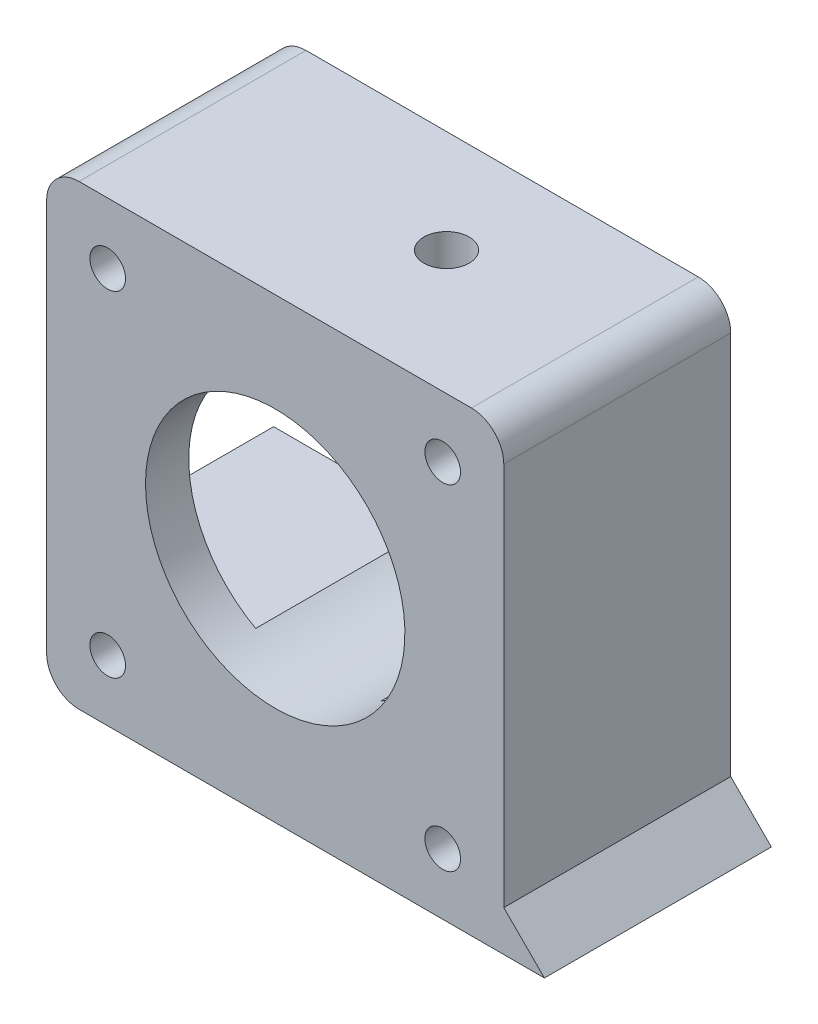
ISO-10303-21;
HEADER;
FILE_DESCRIPTION(('STEP AP214'),'2;1');
FILE_NAME('part.step','',(''),(''),'','','');
FILE_SCHEMA(('AUTOMOTIVE_DESIGN { 1 0 10303 214 1 1 1 1 }'));
ENDSEC;
DATA;
#1=APPLICATION_CONTEXT('core data for automotive mechanical design processes');
#2=APPLICATION_PROTOCOL_DEFINITION('international standard','automotive_design',2000,#1);
#3=PRODUCT_CONTEXT('',#1,'mechanical');
#4=PRODUCT('Part','Part','',(#3));
#5=PRODUCT_RELATED_PRODUCT_CATEGORY('part','',(#4));
#6=PRODUCT_DEFINITION_FORMATION('','',#4);
#7=PRODUCT_DEFINITION_CONTEXT('part definition',#1,'design');
#8=PRODUCT_DEFINITION('design','',#6,#7);
#9=PRODUCT_DEFINITION_SHAPE('','',#8);
#10=(LENGTH_UNIT() NAMED_UNIT(*) SI_UNIT(.MILLI.,.METRE.));
#11=(NAMED_UNIT(*) PLANE_ANGLE_UNIT() SI_UNIT($,.RADIAN.));
#12=(NAMED_UNIT(*) SI_UNIT($,.STERADIAN.) SOLID_ANGLE_UNIT());
#13=UNCERTAINTY_MEASURE_WITH_UNIT(LENGTH_MEASURE(1.E-05),#10,'distance_accuracy_value','');
#14=(GEOMETRIC_REPRESENTATION_CONTEXT(3) GLOBAL_UNCERTAINTY_ASSIGNED_CONTEXT((#13)) GLOBAL_UNIT_ASSIGNED_CONTEXT((#10,
#11,#12)) REPRESENTATION_CONTEXT('',''));
#15=CARTESIAN_POINT('',(0.,0.,0.));
#16=DIRECTION('',(0.,0.,1.));
#17=DIRECTION('',(1.,0.,0.));
#18=AXIS2_PLACEMENT_3D('',#15,#16,#17);
#19=CARTESIAN_POINT('',(0.,0.,0.));
#20=DIRECTION('',(0.,0.,-1.));
#21=DIRECTION('',(-1.,0.,0.));
#22=AXIS2_PLACEMENT_3D('',#19,#20,#21);
#23=PLANE('',#22);
#24=DIRECTION('',(0.,-1.,0.));
#25=VECTOR('',#24,1.);
#26=CARTESIAN_POINT('',(3.55999685738537,-7.02140137308997,0.));
#27=LINE('',#26,#25);
#28=CARTESIAN_POINT('',(3.55999685738537,-11.37140137309,0.));
#29=VERTEX_POINT('',#28);
#30=CARTESIAN_POINT('',(3.55999685738537,-22.02140137309,0.));
#31=VERTEX_POINT('',#30);
#32=EDGE_CURVE('E48',#29,#31,#27,.T.);
#33=ORIENTED_EDGE('',*,*,#32,.F.);
#34=DIRECTION('',(-1.,0.,0.));
#35=VECTOR('',#34,1.);
#36=CARTESIAN_POINT('',(15.9599968573854,-11.37140137309,0.));
#37=LINE('',#36,#35);
#38=CARTESIAN_POINT('',(15.9599968573854,-11.37140137309,0.));
#39=VERTEX_POINT('',#38);
#40=EDGE_CURVE('E228',#39,#29,#37,.T.);
#41=ORIENTED_EDGE('',*,*,#40,.F.);
#42=DIRECTION('',(0.,-1.,0.));
#43=VECTOR('',#42,1.);
#44=CARTESIAN_POINT('',(15.9599968573854,9.62859862691002,0.));
#45=LINE('',#44,#43);
#46=CARTESIAN_POINT('',(15.9599968573854,9.62859862691002,0.));
#47=VERTEX_POINT('',#46);
#48=EDGE_CURVE('E213',#47,#39,#45,.T.);
#49=ORIENTED_EDGE('',*,*,#48,.F.);
#50=DIRECTION('',(-1.,0.,0.));
#51=VECTOR('',#50,1.);
#52=CARTESIAN_POINT('',(15.9599968573854,9.62859862691002,0.));
#53=LINE('',#52,#51);
#54=CARTESIAN_POINT('',(2.91947187669669,9.62859862691002,0.));
#55=VERTEX_POINT('',#54);
#56=EDGE_CURVE('E232',#47,#55,#53,.T.);
#57=ORIENTED_EDGE('',*,*,#56,.T.);
#58=CARTESIAN_POINT('',(-2.89000314261446,-0.871401373089968,0.));
#59=DIRECTION('',(0.,0.,-1.));
#60=DIRECTION('',(-1.,0.,0.));
#61=AXIS2_PLACEMENT_3D('',#58,#59,#60);
#62=CIRCLE('',#61,12.);
#63=CARTESIAN_POINT('',(-8.69947816192561,9.62859862691002,0.));
#64=VERTEX_POINT('',#63);
#65=EDGE_CURVE('E353',#55,#64,#62,.F.);
#66=ORIENTED_EDGE('',*,*,#65,.T.);
#67=CARTESIAN_POINT('',(-24.0400031426146,9.62859862691002,0.));
#68=VERTEX_POINT('',#67);
#69=EDGE_CURVE('E235',#64,#68,#53,.T.);
#70=ORIENTED_EDGE('',*,*,#69,.T.);
#71=DIRECTION('',(0.,-1.,0.));
#72=VECTOR('',#71,1.);
#73=CARTESIAN_POINT('',(-24.0400031426146,20.27859862691,0.));
#74=LINE('',#73,#72);
#75=CARTESIAN_POINT('',(-24.0400031426146,17.27859862691,0.));
#76=VERTEX_POINT('',#75);
#77=EDGE_CURVE('E278',#76,#68,#74,.T.);
#78=ORIENTED_EDGE('',*,*,#77,.F.);
#79=CARTESIAN_POINT('',(-21.0400031426146,17.27859862691,0.));
#80=DIRECTION('',(0.,0.,-1.));
#81=DIRECTION('',(-1.,0.,0.));
#82=AXIS2_PLACEMENT_3D('',#79,#80,#81);
#83=CIRCLE('',#82,3.);
#84=CARTESIAN_POINT('',(-21.0400031426146,20.27859862691,0.));
#85=VERTEX_POINT('',#84);
#86=EDGE_CURVE('E299',#76,#85,#83,.T.);
#87=ORIENTED_EDGE('',*,*,#86,.T.);
#88=DIRECTION('',(-1.,0.,0.));
#89=VECTOR('',#88,1.);
#90=CARTESIAN_POINT('',(-24.0400031426146,20.27859862691,0.));
#91=LINE('',#90,#89);
#92=CARTESIAN_POINT('',(15.2599968573854,20.27859862691,0.));
#93=VERTEX_POINT('',#92);
#94=EDGE_CURVE('E267',#93,#85,#91,.T.);
#95=ORIENTED_EDGE('',*,*,#94,.F.);
#96=CARTESIAN_POINT('',(15.2599968573854,17.27859862691,0.));
#97=DIRECTION('',(0.,0.,-1.));
#98=DIRECTION('',(-1.,0.,0.));
#99=AXIS2_PLACEMENT_3D('',#96,#97,#98);
#100=CIRCLE('',#99,3.);
#101=CARTESIAN_POINT('',(18.2599968573854,17.27859862691,0.));
#102=VERTEX_POINT('',#101);
#103=EDGE_CURVE('E297',#93,#102,#100,.T.);
#104=ORIENTED_EDGE('',*,*,#103,.T.);
#105=DIRECTION('',(0.,1.,0.));
#106=VECTOR('',#105,1.);
#107=CARTESIAN_POINT('',(18.2599968573854,20.27859862691,0.));
#108=LINE('',#107,#106);
#109=CARTESIAN_POINT('',(18.2599968573854,-18.26140137309,0.));
#110=VERTEX_POINT('',#109);
#111=EDGE_CURVE('E285',#110,#102,#108,.T.);
#112=ORIENTED_EDGE('',*,*,#111,.F.);
#113=DIRECTION('',(-0.707106781186553,0.707106781186542,0.));
#114=VECTOR('',#113,1.);
#115=CARTESIAN_POINT('',(18.2599968573854,-18.26140137309,0.));
#116=LINE('',#115,#114);
#117=CARTESIAN_POINT('',(22.0199968573855,-22.02140137309,0.));
#118=VERTEX_POINT('',#117);
#119=EDGE_CURVE('E283',#118,#110,#116,.T.);
#120=ORIENTED_EDGE('',*,*,#119,.F.);
#121=DIRECTION('',(1.,0.,0.));
#122=VECTOR('',#121,1.);
#123=CARTESIAN_POINT('',(22.0199968573855,-22.02140137309,0.));
#124=LINE('',#123,#122);
#125=EDGE_CURVE('E281',#31,#118,#124,.T.);
#126=ORIENTED_EDGE('',*,*,#125,.F.);
#127=EDGE_LOOP('',(#33,#41,#49,#57,#66,#70,#78,#87,#95,#104,#112,#120,#126));
#128=FACE_BOUND('',#127,.T.);
#129=CARTESIAN_POINT('',(12.6099968573857,-16.37140137309,0.));
#130=DIRECTION('',(0.,0.,1.));
#131=DIRECTION('',(1.,0.,0.));
#132=AXIS2_PLACEMENT_3D('',#129,#130,#131);
#133=CIRCLE('',#132,1.65);
#134=CARTESIAN_POINT('',(14.2599968573857,-16.37140137309,0.));
#135=VERTEX_POINT('',#134);
#136=EDGE_CURVE('E226',#135,#135,#133,.T.);
#137=ORIENTED_EDGE('',*,*,#136,.T.);
#138=EDGE_LOOP('',(#137));
#139=FACE_BOUND('',#138,.T.);
#140=CARTESIAN_POINT('',(12.6099968573854,14.62859862691,0.));
#141=DIRECTION('',(0.,0.,1.));
#142=DIRECTION('',(1.,0.,0.));
#143=AXIS2_PLACEMENT_3D('',#140,#141,#142);
#144=CIRCLE('',#143,1.65);
#145=CARTESIAN_POINT('',(14.2599968573854,14.62859862691,0.));
#146=VERTEX_POINT('',#145);
#147=EDGE_CURVE('E248',#146,#146,#144,.T.);
#148=ORIENTED_EDGE('',*,*,#147,.T.);
#149=EDGE_LOOP('',(#148));
#150=FACE_BOUND('',#149,.T.);
#151=CARTESIAN_POINT('',(-18.3900031426146,14.62859862691,0.));
#152=DIRECTION('',(0.,0.,1.));
#153=DIRECTION('',(1.,0.,0.));
#154=AXIS2_PLACEMENT_3D('',#151,#152,#153);
#155=CIRCLE('',#154,1.65);
#156=CARTESIAN_POINT('',(-16.7400031426146,14.62859862691,0.));
#157=VERTEX_POINT('',#156);
#158=EDGE_CURVE('E254',#157,#157,#155,.T.);
#159=ORIENTED_EDGE('',*,*,#158,.T.);
#160=EDGE_LOOP('',(#159));
#161=FACE_BOUND('',#160,.T.);
#162=ADVANCED_FACE('F33',(#128,#139,#150,#161),#23,.T.);
#163=CARTESIAN_POINT('',(15.9599968573854,9.62859862691002,17.));
#164=DIRECTION('',(0.,0.,1.));
#165=DIRECTION('',(1.,0.,0.));
#166=AXIS2_PLACEMENT_3D('',#163,#164,#165);
#167=PLANE('',#166);
#168=CARTESIAN_POINT('',(-2.89000314261446,-0.871401373089968,17.));
#169=DIRECTION('',(0.,0.,1.));
#170=DIRECTION('',(1.,0.,0.));
#171=AXIS2_PLACEMENT_3D('',#168,#169,#170);
#172=CIRCLE('',#171,12.);
#173=CARTESIAN_POINT('',(-8.69947816192557,-11.37140137309,17.));
#174=VERTEX_POINT('',#173);
#175=CARTESIAN_POINT('',(-8.69947816192561,9.62859862691002,17.));
#176=VERTEX_POINT('',#175);
#177=EDGE_CURVE('E348',#174,#176,#172,.F.);
#178=ORIENTED_EDGE('',*,*,#177,.F.);
#179=DIRECTION('',(-1.,0.,0.));
#180=VECTOR('',#179,1.);
#181=CARTESIAN_POINT('',(15.9599968573854,-11.37140137309,17.));
#182=LINE('',#181,#180);
#183=CARTESIAN_POINT('',(-24.0400031426146,-11.37140137309,17.));
#184=VERTEX_POINT('',#183);
#185=EDGE_CURVE('E227',#174,#184,#182,.T.);
#186=ORIENTED_EDGE('',*,*,#185,.T.);
#187=DIRECTION('',(0.,1.,0.));
#188=VECTOR('',#187,1.);
#189=CARTESIAN_POINT('',(-24.0400031426146,9.62859862691002,17.));
#190=LINE('',#189,#188);
#191=CARTESIAN_POINT('',(-24.0400031426146,9.62859862691002,17.));
#192=VERTEX_POINT('',#191);
#193=EDGE_CURVE('E196',#184,#192,#190,.T.);
#194=ORIENTED_EDGE('',*,*,#193,.T.);
#195=DIRECTION('',(-1.,0.,0.));
#196=VECTOR('',#195,1.);
#197=CARTESIAN_POINT('',(15.9599968573854,9.62859862691002,17.));
#198=LINE('',#197,#196);
#199=EDGE_CURVE('E217',#176,#192,#198,.T.);
#200=ORIENTED_EDGE('',*,*,#199,.F.);
#201=EDGE_LOOP('',(#178,#186,#194,#200));
#202=FACE_BOUND('',#201,.T.);
#203=ADVANCED_FACE('F413',(#202),#167,.F.);
#204=CARTESIAN_POINT('',(15.9599968573854,-11.37140137309,17.));
#205=DIRECTION('',(0.,-1.,0.));
#206=DIRECTION('',(0.,0.,-1.));
#207=AXIS2_PLACEMENT_3D('',#204,#205,#206);
#208=PLANE('',#207);
#209=ORIENTED_EDGE('',*,*,#40,.T.);
#210=DIRECTION('',(0.,0.,1.));
#211=VECTOR('',#210,1.);
#212=CARTESIAN_POINT('',(3.55999685738537,-11.37140137309,17.));
#213=LINE('',#212,#211);
#214=CARTESIAN_POINT('',(3.55999685738537,-11.37140137309,9.5));
#215=VERTEX_POINT('',#214);
#216=EDGE_CURVE('E666',#29,#215,#213,.T.);
#217=ORIENTED_EDGE('',*,*,#216,.T.);
#218=CARTESIAN_POINT('',(1.45999685738537,-11.37140137309,9.5));
#219=DIRECTION('',(0.,-1.,0.));
#220=DIRECTION('',(0.,0.,-1.));
#221=AXIS2_PLACEMENT_3D('',#218,#219,#220);
#222=CIRCLE('',#221,2.1);
#223=CARTESIAN_POINT('',(2.91947187669666,-11.37140137309,11.0099445910385));
#224=VERTEX_POINT('',#223);
#225=EDGE_CURVE('E197',#215,#224,#222,.T.);
#226=ORIENTED_EDGE('',*,*,#225,.T.);
#227=DIRECTION('',(0.,0.,1.));
#228=VECTOR('',#227,1.);
#229=CARTESIAN_POINT('',(2.91947187669665,-11.37140137309,-10.));
#230=LINE('',#229,#228);
#231=CARTESIAN_POINT('',(2.91947187669665,-11.37140137309,17.));
#232=VERTEX_POINT('',#231);
#233=EDGE_CURVE('E674',#232,#224,#230,.F.);
#234=ORIENTED_EDGE('',*,*,#233,.F.);
#235=CARTESIAN_POINT('',(15.9599968573854,-11.37140137309,17.));
#236=VERTEX_POINT('',#235);
#237=EDGE_CURVE('E223',#236,#232,#182,.T.);
#238=ORIENTED_EDGE('',*,*,#237,.F.);
#239=DIRECTION('',(0.,0.,1.));
#240=VECTOR('',#239,1.);
#241=CARTESIAN_POINT('',(15.9599968573854,-11.37140137309,17.));
#242=LINE('',#241,#240);
#243=EDGE_CURVE('E215',#39,#236,#242,.T.);
#244=ORIENTED_EDGE('',*,*,#243,.F.);
#245=EDGE_LOOP('',(#209,#217,#226,#234,#238,#244));
#246=FACE_BOUND('',#245,.T.);
#247=ADVANCED_FACE('F419',(#246),#208,.F.);
#248=DIRECTION('',(0.,0.,1.));
#249=VECTOR('',#248,1.);
#250=CARTESIAN_POINT('',(-8.69947816192557,-11.37140137309,-10.));
#251=LINE('',#250,#249);
#252=CARTESIAN_POINT('',(-8.69947816192557,-11.37140137309,0.));
#253=VERTEX_POINT('',#252);
#254=EDGE_CURVE('E349',#253,#174,#251,.T.);
#255=ORIENTED_EDGE('',*,*,#254,.F.);
#256=CARTESIAN_POINT('',(-24.0400031426146,-11.37140137309,0.));
#257=VERTEX_POINT('',#256);
#258=EDGE_CURVE('E231',#253,#257,#37,.T.);
#259=ORIENTED_EDGE('',*,*,#258,.T.);
#260=DIRECTION('',(0.,0.,1.));
#261=VECTOR('',#260,1.);
#262=CARTESIAN_POINT('',(-24.0400031426146,-11.37140137309,17.));
#263=LINE('',#262,#261);
#264=EDGE_CURVE('E210',#257,#184,#263,.T.);
#265=ORIENTED_EDGE('',*,*,#264,.T.);
#266=ORIENTED_EDGE('',*,*,#185,.F.);
#267=EDGE_LOOP('',(#255,#259,#265,#266));
#268=FACE_BOUND('',#267,.T.);
#269=ADVANCED_FACE('F552',(#268),#208,.F.);
#270=CARTESIAN_POINT('',(15.9599968573854,9.62859862691002,0.));
#271=DIRECTION('',(0.,1.,0.));
#272=DIRECTION('',(-1.,0.,0.));
#273=AXIS2_PLACEMENT_3D('',#270,#271,#272);
#274=PLANE('',#273);
#275=DIRECTION('',(0.,0.,1.));
#276=VECTOR('',#275,1.);
#277=CARTESIAN_POINT('',(-8.69947816192561,9.62859862691002,-10.));
#278=LINE('',#277,#276);
#279=EDGE_CURVE('E351',#176,#64,#278,.F.);
#280=ORIENTED_EDGE('',*,*,#279,.F.);
#281=ORIENTED_EDGE('',*,*,#199,.T.);
#282=DIRECTION('',(0.,0.,-1.));
#283=VECTOR('',#282,1.);
#284=CARTESIAN_POINT('',(-24.0400031426146,9.62859862691002,0.));
#285=LINE('',#284,#283);
#286=EDGE_CURVE('E200',#192,#68,#285,.T.);
#287=ORIENTED_EDGE('',*,*,#286,.T.);
#288=ORIENTED_EDGE('',*,*,#69,.F.);
#289=EDGE_LOOP('',(#280,#281,#287,#288));
#290=FACE_BOUND('',#289,.T.);
#291=ADVANCED_FACE('F557',(#290),#274,.F.);
#292=DIRECTION('',(0.,0.,1.));
#293=VECTOR('',#292,1.);
#294=CARTESIAN_POINT('',(2.91947187669669,9.62859862691002,-10.));
#295=LINE('',#294,#293);
#296=CARTESIAN_POINT('',(2.91947187669668,9.62859862691003,7.99005540896156));
#297=VERTEX_POINT('',#296);
#298=EDGE_CURVE('E347',#55,#297,#295,.T.);
#299=ORIENTED_EDGE('',*,*,#298,.F.);
#300=ORIENTED_EDGE('',*,*,#56,.F.);
#301=DIRECTION('',(0.,0.,-1.));
#302=VECTOR('',#301,1.);
#303=CARTESIAN_POINT('',(15.9599968573854,9.62859862691002,0.));
#304=LINE('',#303,#302);
#305=CARTESIAN_POINT('',(15.9599968573854,9.62859862691002,17.));
#306=VERTEX_POINT('',#305);
#307=EDGE_CURVE('E209',#306,#47,#304,.T.);
#308=ORIENTED_EDGE('',*,*,#307,.F.);
#309=CARTESIAN_POINT('',(2.91947187669669,9.62859862691002,17.));
#310=VERTEX_POINT('',#309);
#311=EDGE_CURVE('E236',#306,#310,#198,.T.);
#312=ORIENTED_EDGE('',*,*,#311,.T.);
#313=CARTESIAN_POINT('',(2.91947187669669,9.62859862691003,11.0099445910384));
#314=VERTEX_POINT('',#313);
#315=EDGE_CURVE('E680',#314,#310,#295,.T.);
#316=ORIENTED_EDGE('',*,*,#315,.F.);
#317=CARTESIAN_POINT('',(1.45999685738537,9.62859862691003,9.5));
#318=DIRECTION('',(0.,1.,0.));
#319=DIRECTION('',(-1.,0.,0.));
#320=AXIS2_PLACEMENT_3D('',#317,#318,#319);
#321=CIRCLE('',#320,2.1);
#322=EDGE_CURVE('E202',#314,#297,#321,.T.);
#323=ORIENTED_EDGE('',*,*,#322,.T.);
#324=EDGE_LOOP('',(#299,#300,#308,#312,#316,#323));
#325=FACE_BOUND('',#324,.T.);
#326=ADVANCED_FACE('F567',(#325),#274,.F.);
#327=CARTESIAN_POINT('',(1.45999685738537,-34.72140137309,9.5));
#328=DIRECTION('',(0.,1.,0.));
#329=DIRECTION('',(0.,0.,1.));
#330=AXIS2_PLACEMENT_3D('',#327,#328,#329);
#331=CYLINDRICAL_SURFACE('',#330,2.1);
#332=CARTESIAN_POINT('',(1.45999685738537,20.27859862691,9.5));
#333=DIRECTION('',(0.,1.,0.));
#334=DIRECTION('',(0.,0.,1.));
#335=AXIS2_PLACEMENT_3D('',#332,#333,#334);
#336=CIRCLE('',#335,2.1);
#337=CARTESIAN_POINT('',(1.45999685738537,20.27859862691,11.6));
#338=VERTEX_POINT('',#337);
#339=EDGE_CURVE('E323',#338,#338,#336,.T.);
#340=ORIENTED_EDGE('',*,*,#339,.T.);
#341=EDGE_LOOP('',(#340));
#342=FACE_BOUND('',#341,.T.);
#343=CARTESIAN_POINT('',(2.91947187669668,9.62859862691003,7.99005540896156));
#344=CARTESIAN_POINT('',(2.87301088734067,9.65430634754156,7.9451562215829));
#345=CARTESIAN_POINT('',(2.82469738280091,9.68063245314042,7.90259689768021));
#346=CARTESIAN_POINT('',(2.72469598338791,9.73418053450045,7.82230654351716));
#347=CARTESIAN_POINT('',(2.67300896029508,9.76140227791739,7.78457427325776));
#348=CARTESIAN_POINT('',(2.5134084522869,9.84388800109616,7.67884930727655));
#349=CARTESIAN_POINT('',(2.40090018332738,9.90000346790074,7.61827537608941));
#350=CARTESIAN_POINT('',(2.16679058377834,10.0118737812288,7.5184236503312));
#351=CARTESIAN_POINT('',(2.04519366082369,10.067628788489,7.47913560823222));
#352=CARTESIAN_POINT('',(1.79584752721615,10.1767339380936,7.42310017717634));
#353=CARTESIAN_POINT('',(1.66809939031723,10.2300844970325,7.40634886888289));
#354=CARTESIAN_POINT('',(1.41018290126881,10.3325094927628,7.3966349561884));
#355=CARTESIAN_POINT('',(1.28001844331849,10.3815901890949,7.40363690596981));
#356=CARTESIAN_POINT('',(1.02130017631667,10.4741067450121,7.44217952257729));
#357=CARTESIAN_POINT('',(0.892745774817818,10.5175447395677,7.47371087672427));
#358=CARTESIAN_POINT('',(0.650361343844336,10.5951131561993,7.55838542882709));
#359=CARTESIAN_POINT('',(0.536119921496784,10.6296693420093,7.60995997885671));
#360=CARTESIAN_POINT('',(0.317414299809351,10.6925694328075,7.73357380654166));
#361=CARTESIAN_POINT('',(0.212946115073686,10.7209158764283,7.8056046935904));
#362=CARTESIAN_POINT('',(0.024130904077665,10.7697646626721,7.96298340442897));
#363=CARTESIAN_POINT('',(-0.0610769157265639,10.790653509275,8.04718075508071));
#364=CARTESIAN_POINT('',(-0.216360988974307,10.8272316889855,8.22950673215559));
#365=CARTESIAN_POINT('',(-0.286440107311133,10.8429220068301,8.32763271509633));
#366=CARTESIAN_POINT('',(-0.407020423033249,10.8690627150111,8.53158172044062));
#367=CARTESIAN_POINT('',(-0.458076521196395,10.8796647633824,8.63705780067353));
#368=CARTESIAN_POINT('',(-0.542016813035271,10.8967253379926,8.85532237701977));
#369=CARTESIAN_POINT('',(-0.574902125803139,10.9031841194087,8.96811042232977));
#370=CARTESIAN_POINT('',(-0.621220883764604,10.9121967244049,9.19667449719368));
#371=CARTESIAN_POINT('',(-0.634830690198114,10.9147859645867,9.31241344053529));
#372=CARTESIAN_POINT('',(-0.642740023593041,10.9162967123904,9.54457303528718));
#373=CARTESIAN_POINT('',(-0.637039821416426,10.9152182714588,9.6609936771124));
#374=CARTESIAN_POINT('',(-0.606529263144325,10.9093449263472,9.89104331535416));
#375=CARTESIAN_POINT('',(-0.581745186033767,10.904555132738,10.0046759291088));
#376=CARTESIAN_POINT('',(-0.5138821199863,10.8910488980822,10.2260912370988));
#377=CARTESIAN_POINT('',(-0.470803482047369,10.8823325323703,10.3338740435234));
#378=CARTESIAN_POINT('',(-0.367698279811135,10.8606377134061,10.5406156886835));
#379=CARTESIAN_POINT('',(-0.307661592884958,10.8476567137436,10.639569210461));
#380=CARTESIAN_POINT('',(-0.172602469693561,10.8170763436501,10.8258409070595));
#381=CARTESIAN_POINT('',(-0.0975803358894269,10.7994770664305,10.9131593166603));
#382=CARTESIAN_POINT('',(0.0654574808517383,10.7592616833816,11.0743158976984));
#383=CARTESIAN_POINT('',(0.153542872032627,10.7366183139533,11.1480766771571));
#384=CARTESIAN_POINT('',(0.33953340337068,10.6862525799156,11.2797610878688));
#385=CARTESIAN_POINT('',(0.437439192877249,10.6585298793478,11.3376836709156));
#386=CARTESIAN_POINT('',(0.642224245062372,10.5974702979901,11.4376561102772));
#387=CARTESIAN_POINT('',(0.749252085374086,10.5640246847937,11.4793344239841));
#388=CARTESIAN_POINT('',(0.967156341251526,10.4923779602586,11.5445172703839));
#389=CARTESIAN_POINT('',(1.07803335269754,10.4541761102303,11.5680189759755));
#390=CARTESIAN_POINT('',(1.30612418006415,10.3717265118637,11.5976634507574));
#391=CARTESIAN_POINT('',(1.42338151587841,10.3272738495699,11.6028958842219));
#392=CARTESIAN_POINT('',(1.65583658879806,10.2349484711356,11.5940848887562));
#393=CARTESIAN_POINT('',(1.77103307086044,10.1870737540738,11.5800300934704));
#394=CARTESIAN_POINT('',(2.00462256587723,10.0857860839585,11.531892641358));
#395=CARTESIAN_POINT('',(2.12267366101802,10.0322201499684,11.4964752112035));
#396=CARTESIAN_POINT('',(2.35054062704294,9.92455009238535,11.4057684862207));
#397=CARTESIAN_POINT('',(2.46036208846327,9.87044636295041,11.3504928320823));
#398=CARTESIAN_POINT('',(2.62829426861122,9.78474725939713,11.2466170620424));
#399=CARTESIAN_POINT('',(2.68982367339744,9.75262869192974,11.2038687398881));
#400=CARTESIAN_POINT('',(2.80823538288824,9.6895925669546,11.1117879282568));
#401=CARTESIAN_POINT('',(2.8651242928364,9.65867333642553,11.0624650701677));
#402=CARTESIAN_POINT('',(2.91947187669668,9.62859862691003,11.0099445910384));
#403=B_SPLINE_CURVE_WITH_KNOTS('',3,(#343,#344,#345,#346,#347,#348,#349,#350,#351,#352,#353,
#354,#355,#356,#357,#358,#359,#360,#361,#362,#363,#364,#365,#366,#367,#368,#369,#370,#371,#372,
#373,#374,#375,#376,#377,#378,#379,#380,#381,#382,#383,#384,#385,#386,#387,#388,#389,#390,#391,
#392,#393,#394,#395,#396,#397,#398,#399,#400,#401,#402),.UNSPECIFIED.,.F.,.F.,(4,2,2,2,2,2,2,2,
2,2,2,2,2,2,2,2,2,2,2,2,2,2,2,2,2,2,2,2,2,4),(0.,0.208463338347776,0.416873017537777,
0.833447413605713,1.24982108234984,1.66612233068065,2.0818026265894,2.49732518490828,
2.88534402371744,3.27320393755252,3.63618661801617,3.99910050072946,4.35039709155337,
4.70167204450773,5.04971177366124,5.3977466208731,5.74530307036276,6.09285285196348,
6.44061053362118,6.78836119696702,7.13803915758511,7.48774025504957,7.84502661910938,
8.20236854258423,8.57728055078269,8.95241359714992,9.35384109427732,9.75499337489747,
9.99917079937089,10.2429943679857),.UNSPECIFIED.);
#404=EDGE_CURVE('E341',#297,#314,#403,.T.);
#405=ORIENTED_EDGE('',*,*,#404,.F.);
#406=ORIENTED_EDGE('',*,*,#322,.F.);
#407=EDGE_LOOP('',(#405,#406));
#408=FACE_BOUND('',#407,.T.);
#409=ADVANCED_FACE('F329',(#342,#408),#331,.F.);
#410=ORIENTED_EDGE('',*,*,#225,.F.);
#411=DIRECTION('',(0.,-1.,0.));
#412=VECTOR('',#411,1.);
#413=CARTESIAN_POINT('',(3.55999685738537,-7.02140137308997,9.5));
#414=LINE('',#413,#412);
#415=CARTESIAN_POINT('',(3.55999685738537,-22.02140137309,9.5));
#416=VERTEX_POINT('',#415);
#417=EDGE_CURVE('E195',#215,#416,#414,.T.);
#418=ORIENTED_EDGE('',*,*,#417,.T.);
#419=CARTESIAN_POINT('',(1.45999685738537,-22.02140137309,9.5));
#420=DIRECTION('',(0.,1.,0.));
#421=DIRECTION('',(0.,0.,1.));
#422=AXIS2_PLACEMENT_3D('',#419,#420,#421);
#423=CIRCLE('',#422,2.1);
#424=CARTESIAN_POINT('',(-0.640003142614627,-22.02140137309,9.5));
#425=VERTEX_POINT('',#424);
#426=EDGE_CURVE('E187',#425,#416,#423,.T.);
#427=ORIENTED_EDGE('',*,*,#426,.F.);
#428=DIRECTION('',(0.,-1.,0.));
#429=VECTOR('',#428,1.);
#430=CARTESIAN_POINT('',(-0.640003142614627,-7.02140137308997,9.5));
#431=LINE('',#430,#429);
#432=CARTESIAN_POINT('',(-0.640003142614627,-12.6585766072163,9.5));
#433=VERTEX_POINT('',#432);
#434=EDGE_CURVE('E173',#433,#425,#431,.T.);
#435=ORIENTED_EDGE('',*,*,#434,.F.);
#436=CARTESIAN_POINT('',(2.91947187669666,-11.37140137309,11.0099445910385));
#437=CARTESIAN_POINT('',(2.87301088734065,-11.3971090937215,11.0548437784171));
#438=CARTESIAN_POINT('',(2.82469738280089,-11.4234351993204,11.0974031023198));
#439=CARTESIAN_POINT('',(2.72469598338789,-11.4769832806804,11.1776934564829));
#440=CARTESIAN_POINT('',(2.67300896029505,-11.5042050240973,11.2154257267423));
#441=CARTESIAN_POINT('',(2.51340845228688,-11.5866907472761,11.3211506927235));
#442=CARTESIAN_POINT('',(2.40090018332736,-11.6428062140807,11.3817246239106));
#443=CARTESIAN_POINT('',(2.16679058377832,-11.7546765274087,11.4815763496688));
#444=CARTESIAN_POINT('',(2.04519366082366,-11.8104315346689,11.5208643917678));
#445=CARTESIAN_POINT('',(1.79584752721613,-11.9195366842735,11.5768998228237));
#446=CARTESIAN_POINT('',(1.6680993903172,-11.9728872432125,11.5936511311171));
#447=CARTESIAN_POINT('',(1.41018290126878,-12.0753122389427,11.6033650438116));
#448=CARTESIAN_POINT('',(1.28001844331846,-12.1243929352748,11.5963630940302));
#449=CARTESIAN_POINT('',(1.02130017631664,-12.2169094911921,11.5578204774227));
#450=CARTESIAN_POINT('',(0.892745774817791,-12.2603474857477,11.5262891232757));
#451=CARTESIAN_POINT('',(0.65036134384431,-12.3379159023793,11.4416145711729));
#452=CARTESIAN_POINT('',(0.536119921496759,-12.3724720881892,11.3900400211433));
#453=CARTESIAN_POINT('',(0.317414299809327,-12.4353721789875,11.2664261934583));
#454=CARTESIAN_POINT('',(0.212946115073663,-12.4637186226082,11.1943953064096));
#455=CARTESIAN_POINT('',(0.0241309040776454,-12.512567408852,11.037016595571));
#456=CARTESIAN_POINT('',(-0.061076915726582,-12.5334562554549,10.9528192449193));
#457=CARTESIAN_POINT('',(-0.216360988974323,-12.5700344351655,10.7704932678444));
#458=CARTESIAN_POINT('',(-0.286440107311148,-12.58572475301,10.6723672849036));
#459=CARTESIAN_POINT('',(-0.407020423033262,-12.611865461191,10.4684182795594));
#460=CARTESIAN_POINT('',(-0.458076521196406,-12.6224675095623,10.3629421993264));
#461=CARTESIAN_POINT('',(-0.542016813035279,-12.6395280841725,10.1446776229802));
#462=CARTESIAN_POINT('',(-0.574902125803145,-12.6459868655887,10.0318895776702));
#463=CARTESIAN_POINT('',(-0.621220883764608,-12.6549994705848,9.8033255028063));
#464=CARTESIAN_POINT('',(-0.634830690198116,-12.6575887107667,9.68758655946469));
#465=CARTESIAN_POINT('',(-0.642740023593041,-12.6590994585703,9.45542696471279));
#466=CARTESIAN_POINT('',(-0.637039821416424,-12.6580210176388,9.33900632288757));
#467=CARTESIAN_POINT('',(-0.606529263144321,-12.6521476725272,9.10895668464582));
#468=CARTESIAN_POINT('',(-0.581745186033761,-12.6473578789179,8.9953240708912));
#469=CARTESIAN_POINT('',(-0.513882119986292,-12.6338516442621,8.77390876290115));
#470=CARTESIAN_POINT('',(-0.47080348204736,-12.6251352785503,8.66612595647653));
#471=CARTESIAN_POINT('',(-0.367698279811123,-12.603440459586,8.45938431131643));
#472=CARTESIAN_POINT('',(-0.307661592884944,-12.5904594599235,8.360430789539));
#473=CARTESIAN_POINT('',(-0.172602469693546,-12.55987908983,8.17415909294051));
#474=CARTESIAN_POINT('',(-0.0975803358894115,-12.5422798126104,8.08684068333964));
#475=CARTESIAN_POINT('',(0.065457480851755,-12.5020644295615,7.92568410230161));
#476=CARTESIAN_POINT('',(0.153542872032645,-12.4794210601332,7.85192332284284));
#477=CARTESIAN_POINT('',(0.3395334033707,-12.4290553260956,7.72023891213118));
#478=CARTESIAN_POINT('',(0.43743919287727,-12.4013326255277,7.66231632908441));
#479=CARTESIAN_POINT('',(0.642224245062396,-12.34027304417,7.56234388972276));
#480=CARTESIAN_POINT('',(0.749252085374111,-12.3068274309736,7.52066557601592));
#481=CARTESIAN_POINT('',(0.967156341251552,-12.2351807064385,7.45548272961614));
#482=CARTESIAN_POINT('',(1.07803335269756,-12.1969788564102,7.43198102402446));
#483=CARTESIAN_POINT('',(1.30612418006418,-12.1145292580436,7.40233654924262));
#484=CARTESIAN_POINT('',(1.42338151587844,-12.0700765957498,7.3971041157781));
#485=CARTESIAN_POINT('',(1.65583658879809,-11.9777512173155,7.40591511124381));
#486=CARTESIAN_POINT('',(1.77103307086046,-11.9298765002537,7.41996990652965));
#487=CARTESIAN_POINT('',(2.00462256587726,-11.8285888301384,7.46810735864203));
#488=CARTESIAN_POINT('',(2.12267366101805,-11.7750228961483,7.50352478879655));
#489=CARTESIAN_POINT('',(2.35054062704297,-11.6673528385653,7.59423151377933));
#490=CARTESIAN_POINT('',(2.4603620884633,-11.6132491091303,7.64950716791772));
#491=CARTESIAN_POINT('',(2.62829426861124,-11.5275500055771,7.75338293795763));
#492=CARTESIAN_POINT('',(2.68982367339745,-11.4954314381097,7.79613126011192));
#493=CARTESIAN_POINT('',(2.80823538288824,-11.4323953131345,7.88821207174319));
#494=CARTESIAN_POINT('',(2.86512429283639,-11.4014760826055,7.9375349298323));
#495=CARTESIAN_POINT('',(2.91947187669666,-11.37140137309,7.99005540896154));
#496=B_SPLINE_CURVE_WITH_KNOTS('',3,(#436,#437,#438,#439,#440,#441,#442,#443,#444,#445,#446,
#447,#448,#449,#450,#451,#452,#453,#454,#455,#456,#457,#458,#459,#460,#461,#462,#463,#464,#465,
#466,#467,#468,#469,#470,#471,#472,#473,#474,#475,#476,#477,#478,#479,#480,#481,#482,#483,#484,
#485,#486,#487,#488,#489,#490,#491,#492,#493,#494,#495),.UNSPECIFIED.,.F.,.F.,(4,2,2,2,2,2,2,2,
2,2,2,2,2,2,2,2,2,2,2,2,2,2,2,2,2,2,2,2,2,4),(0.,0.208463338347777,0.416873017537779,
0.833447413605715,1.24982108234984,1.66612233068065,2.0818026265894,2.49732518490829,
2.88534402371745,3.27320393755253,3.63618661801617,3.99910050072946,4.35039709155337,
4.70167204450773,5.04971177366124,5.3977466208731,5.74530307036276,6.09285285196347,
6.44061053362117,6.78836119696702,7.13803915758511,7.48774025504957,7.84502661910937,
8.20236854258423,8.57728055078269,8.95241359714992,9.35384109427732,9.75499337489747,
9.99917079937086,10.2429943679857),.UNSPECIFIED.);
#497=EDGE_CURVE('E41',#224,#433,#496,.T.);
#498=ORIENTED_EDGE('',*,*,#497,.F.);
#499=EDGE_LOOP('',(#410,#418,#427,#435,#498));
#500=FACE_BOUND('',#499,.T.);
#501=ADVANCED_FACE('F194',(#500),#331,.F.);
#502=CARTESIAN_POINT('',(0.,0.,21.));
#503=DIRECTION('',(0.,0.,-1.));
#504=DIRECTION('',(-1.,0.,0.));
#505=AXIS2_PLACEMENT_3D('',#502,#503,#504);
#506=PLANE('',#505);
#507=CARTESIAN_POINT('',(-2.89000314261446,-0.871401373089968,21.));
#508=DIRECTION('',(0.,0.,-1.));
#509=DIRECTION('',(-1.,0.,0.));
#510=AXIS2_PLACEMENT_3D('',#507,#508,#509);
#511=CIRCLE('',#510,12.);
#512=CARTESIAN_POINT('',(-14.8900031426145,-0.871401373089968,21.));
#513=VERTEX_POINT('',#512);
#514=EDGE_CURVE('E354',#513,#513,#511,.F.);
#515=ORIENTED_EDGE('',*,*,#514,.F.);
#516=EDGE_LOOP('',(#515));
#517=FACE_BOUND('',#516,.T.);
#518=DIRECTION('',(0.,-1.,0.));
#519=VECTOR('',#518,1.);
#520=CARTESIAN_POINT('',(-24.0400031426146,20.27859862691,21.));
#521=LINE('',#520,#519);
#522=CARTESIAN_POINT('',(-24.0400031426146,17.27859862691,21.));
#523=VERTEX_POINT('',#522);
#524=CARTESIAN_POINT('',(-24.0400031426146,-19.02140137309,21.));
#525=VERTEX_POINT('',#524);
#526=EDGE_CURVE('E263',#523,#525,#521,.T.);
#527=ORIENTED_EDGE('',*,*,#526,.T.);
#528=CARTESIAN_POINT('',(-21.0400031426146,-19.02140137309,21.));
#529=DIRECTION('',(0.,0.,-1.));
#530=DIRECTION('',(-1.,0.,0.));
#531=AXIS2_PLACEMENT_3D('',#528,#529,#530);
#532=CIRCLE('',#531,3.);
#533=CARTESIAN_POINT('',(-21.0400031426146,-22.02140137309,21.));
#534=VERTEX_POINT('',#533);
#535=EDGE_CURVE('E313',#525,#534,#532,.F.);
#536=ORIENTED_EDGE('',*,*,#535,.T.);
#537=DIRECTION('',(1.,0.,0.));
#538=VECTOR('',#537,1.);
#539=CARTESIAN_POINT('',(-6.95421670498766,-22.02140137309,21.));
#540=LINE('',#539,#538);
#541=CARTESIAN_POINT('',(22.0199968573855,-22.02140137309,21.));
#542=VERTEX_POINT('',#541);
#543=EDGE_CURVE('E266',#534,#542,#540,.T.);
#544=ORIENTED_EDGE('',*,*,#543,.T.);
#545=DIRECTION('',(-0.707106781186553,0.707106781186542,0.));
#546=VECTOR('',#545,1.);
#547=CARTESIAN_POINT('',(18.2599968573854,-18.26140137309,21.));
#548=LINE('',#547,#546);
#549=CARTESIAN_POINT('',(18.2599968573854,-18.26140137309,21.));
#550=VERTEX_POINT('',#549);
#551=EDGE_CURVE('E269',#542,#550,#548,.T.);
#552=ORIENTED_EDGE('',*,*,#551,.T.);
#553=DIRECTION('',(0.,1.,0.));
#554=VECTOR('',#553,1.);
#555=CARTESIAN_POINT('',(18.2599968573854,20.27859862691,21.));
#556=LINE('',#555,#554);
#557=CARTESIAN_POINT('',(18.2599968573854,17.27859862691,21.));
#558=VERTEX_POINT('',#557);
#559=EDGE_CURVE('E271',#550,#558,#556,.T.);
#560=ORIENTED_EDGE('',*,*,#559,.T.);
#561=CARTESIAN_POINT('',(15.2599968573854,17.27859862691,21.));
#562=DIRECTION('',(0.,0.,-1.));
#563=DIRECTION('',(-1.,0.,0.));
#564=AXIS2_PLACEMENT_3D('',#561,#562,#563);
#565=CIRCLE('',#564,3.);
#566=CARTESIAN_POINT('',(15.2599968573854,20.27859862691,21.));
#567=VERTEX_POINT('',#566);
#568=EDGE_CURVE('E309',#558,#567,#565,.F.);
#569=ORIENTED_EDGE('',*,*,#568,.T.);
#570=DIRECTION('',(-1.,0.,0.));
#571=VECTOR('',#570,1.);
#572=CARTESIAN_POINT('',(-24.0400031426146,20.27859862691,21.));
#573=LINE('',#572,#571);
#574=CARTESIAN_POINT('',(-21.0400031426146,20.27859862691,21.));
#575=VERTEX_POINT('',#574);
#576=EDGE_CURVE('E274',#567,#575,#573,.T.);
#577=ORIENTED_EDGE('',*,*,#576,.T.);
#578=CARTESIAN_POINT('',(-21.0400031426146,17.27859862691,21.));
#579=DIRECTION('',(0.,0.,-1.));
#580=DIRECTION('',(-1.,0.,0.));
#581=AXIS2_PLACEMENT_3D('',#578,#579,#580);
#582=CIRCLE('',#581,3.);
#583=EDGE_CURVE('E311',#575,#523,#582,.F.);
#584=ORIENTED_EDGE('',*,*,#583,.T.);
#585=EDGE_LOOP('',(#527,#536,#544,#552,#560,#569,#577,#584));
#586=FACE_BOUND('',#585,.T.);
#587=CARTESIAN_POINT('',(-18.3900031426146,14.62859862691,21.));
#588=DIRECTION('',(0.,0.,1.));
#589=DIRECTION('',(1.,0.,0.));
#590=AXIS2_PLACEMENT_3D('',#587,#588,#589);
#591=CIRCLE('',#590,1.65);
#592=CARTESIAN_POINT('',(-16.7400031426146,14.62859862691,21.));
#593=VERTEX_POINT('',#592);
#594=EDGE_CURVE('E257',#593,#593,#591,.T.);
#595=ORIENTED_EDGE('',*,*,#594,.F.);
#596=EDGE_LOOP('',(#595));
#597=FACE_BOUND('',#596,.T.);
#598=CARTESIAN_POINT('',(12.6099968573854,14.62859862691,21.));
#599=DIRECTION('',(0.,0.,1.));
#600=DIRECTION('',(1.,0.,0.));
#601=AXIS2_PLACEMENT_3D('',#598,#599,#600);
#602=CIRCLE('',#601,1.65);
#603=CARTESIAN_POINT('',(14.2599968573854,14.62859862691,21.));
#604=VERTEX_POINT('',#603);
#605=EDGE_CURVE('E251',#604,#604,#602,.T.);
#606=ORIENTED_EDGE('',*,*,#605,.F.);
#607=EDGE_LOOP('',(#606));
#608=FACE_BOUND('',#607,.T.);
#609=CARTESIAN_POINT('',(-18.3900031426143,-16.37140137309,21.));
#610=DIRECTION('',(0.,0.,1.));
#611=DIRECTION('',(1.,0.,0.));
#612=AXIS2_PLACEMENT_3D('',#609,#610,#611);
#613=CIRCLE('',#612,1.65);
#614=CARTESIAN_POINT('',(-16.7400031426143,-16.37140137309,21.));
#615=VERTEX_POINT('',#614);
#616=EDGE_CURVE('E245',#615,#615,#613,.T.);
#617=ORIENTED_EDGE('',*,*,#616,.F.);
#618=EDGE_LOOP('',(#617));
#619=FACE_BOUND('',#618,.T.);
#620=CARTESIAN_POINT('',(12.6099968573857,-16.37140137309,21.));
#621=DIRECTION('',(0.,0.,1.));
#622=DIRECTION('',(1.,0.,0.));
#623=AXIS2_PLACEMENT_3D('',#620,#621,#622);
#624=CIRCLE('',#623,1.65);
#625=CARTESIAN_POINT('',(14.2599968573857,-16.37140137309,21.));
#626=VERTEX_POINT('',#625);
#627=EDGE_CURVE('E239',#626,#626,#624,.T.);
#628=ORIENTED_EDGE('',*,*,#627,.F.);
#629=EDGE_LOOP('',(#628));
#630=FACE_BOUND('',#629,.T.);
#631=ADVANCED_FACE('F378',(#517,#586,#597,#608,#619,#630),#506,.F.);
#632=DIRECTION('',(0.,-1.,0.));
#633=VECTOR('',#632,1.);
#634=CARTESIAN_POINT('',(-0.640003142614626,-7.02140137308997,0.));
#635=LINE('',#634,#633);
#636=CARTESIAN_POINT('',(-0.640003142614626,-12.6585766072163,0.));
#637=VERTEX_POINT('',#636);
#638=CARTESIAN_POINT('',(-0.640003142614626,-22.02140137309,0.));
#639=VERTEX_POINT('',#638);
#640=EDGE_CURVE('E55',#637,#639,#635,.T.);
#641=ORIENTED_EDGE('',*,*,#640,.T.);
#642=CARTESIAN_POINT('',(-21.0400031426146,-22.02140137309,0.));
#643=VERTEX_POINT('',#642);
#644=EDGE_CURVE('E190',#643,#639,#124,.T.);
#645=ORIENTED_EDGE('',*,*,#644,.F.);
#646=CARTESIAN_POINT('',(-21.0400031426146,-19.02140137309,0.));
#647=DIRECTION('',(0.,0.,-1.));
#648=DIRECTION('',(-1.,0.,0.));
#649=AXIS2_PLACEMENT_3D('',#646,#647,#648);
#650=CIRCLE('',#649,3.);
#651=CARTESIAN_POINT('',(-24.0400031426146,-19.02140137309,0.));
#652=VERTEX_POINT('',#651);
#653=EDGE_CURVE('E301',#643,#652,#650,.T.);
#654=ORIENTED_EDGE('',*,*,#653,.T.);
#655=EDGE_CURVE('E260',#257,#652,#74,.T.);
#656=ORIENTED_EDGE('',*,*,#655,.F.);
#657=ORIENTED_EDGE('',*,*,#258,.F.);
#658=EDGE_CURVE('E679',#253,#637,#62,.F.);
#659=ORIENTED_EDGE('',*,*,#658,.T.);
#660=EDGE_LOOP('',(#641,#645,#654,#656,#657,#659));
#661=FACE_BOUND('',#660,.T.);
#662=CARTESIAN_POINT('',(-18.3900031426143,-16.37140137309,0.));
#663=DIRECTION('',(0.,0.,1.));
#664=DIRECTION('',(1.,0.,0.));
#665=AXIS2_PLACEMENT_3D('',#662,#663,#664);
#666=CIRCLE('',#665,1.65);
#667=CARTESIAN_POINT('',(-16.7400031426143,-16.37140137309,0.));
#668=VERTEX_POINT('',#667);
#669=EDGE_CURVE('E242',#668,#668,#666,.T.);
#670=ORIENTED_EDGE('',*,*,#669,.T.);
#671=EDGE_LOOP('',(#670));
#672=FACE_BOUND('',#671,.T.);
#673=ADVANCED_FACE('F415',(#661,#672),#23,.T.);
#674=CARTESIAN_POINT('',(-24.0400031426146,20.27859862691,21.));
#675=DIRECTION('',(1.,0.,0.));
#676=DIRECTION('',(0.,1.,0.));
#677=AXIS2_PLACEMENT_3D('',#674,#675,#676);
#678=PLANE('',#677);
#679=ORIENTED_EDGE('',*,*,#193,.F.);
#680=ORIENTED_EDGE('',*,*,#264,.F.);
#681=ORIENTED_EDGE('',*,*,#655,.T.);
#682=DIRECTION('',(0.,0.,-1.));
#683=VECTOR('',#682,1.);
#684=CARTESIAN_POINT('',(-24.0400031426146,-19.02140137309,21.));
#685=LINE('',#684,#683);
#686=EDGE_CURVE('E307',#652,#525,#685,.F.);
#687=ORIENTED_EDGE('',*,*,#686,.T.);
#688=ORIENTED_EDGE('',*,*,#526,.F.);
#689=DIRECTION('',(0.,0.,-1.));
#690=VECTOR('',#689,1.);
#691=CARTESIAN_POINT('',(-24.0400031426146,17.27859862691,21.));
#692=LINE('',#691,#690);
#693=EDGE_CURVE('E304',#523,#76,#692,.T.);
#694=ORIENTED_EDGE('',*,*,#693,.T.);
#695=ORIENTED_EDGE('',*,*,#77,.T.);
#696=ORIENTED_EDGE('',*,*,#286,.F.);
#697=EDGE_LOOP('',(#679,#680,#681,#687,#688,#694,#695,#696));
#698=FACE_BOUND('',#697,.T.);
#699=ADVANCED_FACE('F383',(#698),#678,.F.);
#700=CARTESIAN_POINT('',(22.0199968573855,-22.02140137309,21.));
#701=DIRECTION('',(0.,1.,0.));
#702=DIRECTION('',(0.,0.,1.));
#703=AXIS2_PLACEMENT_3D('',#700,#701,#702);
#704=PLANE('',#703);
#705=ORIENTED_EDGE('',*,*,#426,.T.);
#706=DIRECTION('',(0.,0.,1.));
#707=VECTOR('',#706,1.);
#708=CARTESIAN_POINT('',(3.55999685738537,-22.02140137309,0.));
#709=LINE('',#708,#707);
#710=EDGE_CURVE('E181',#31,#416,#709,.T.);
#711=ORIENTED_EDGE('',*,*,#710,.F.);
#712=ORIENTED_EDGE('',*,*,#125,.T.);
#713=DIRECTION('',(0.,0.,-1.));
#714=VECTOR('',#713,1.);
#715=CARTESIAN_POINT('',(22.0199968573855,-22.02140137309,21.));
#716=LINE('',#715,#714);
#717=EDGE_CURVE('E292',#542,#118,#716,.T.);
#718=ORIENTED_EDGE('',*,*,#717,.F.);
#719=ORIENTED_EDGE('',*,*,#543,.F.);
#720=DIRECTION('',(0.,0.,-1.));
#721=VECTOR('',#720,1.);
#722=CARTESIAN_POINT('',(-21.0400031426146,-22.02140137309,21.));
#723=LINE('',#722,#721);
#724=EDGE_CURVE('E295',#534,#643,#723,.T.);
#725=ORIENTED_EDGE('',*,*,#724,.T.);
#726=ORIENTED_EDGE('',*,*,#644,.T.);
#727=DIRECTION('',(0.,0.,-1.));
#728=VECTOR('',#727,1.);
#729=CARTESIAN_POINT('',(-0.640003142614627,-22.02140137309,9.5));
#730=LINE('',#729,#728);
#731=EDGE_CURVE('E176',#425,#639,#730,.T.);
#732=ORIENTED_EDGE('',*,*,#731,.F.);
#733=EDGE_LOOP('',(#705,#711,#712,#718,#719,#725,#726,#732));
#734=FACE_BOUND('',#733,.T.);
#735=ADVANCED_FACE('F186',(#734),#704,.F.);
#736=CARTESIAN_POINT('',(18.2599968573854,-18.26140137309,21.));
#737=DIRECTION('',(-0.707106781186542,-0.707106781186553,0.));
#738=DIRECTION('',(0.707106781186553,-0.707106781186542,0.));
#739=AXIS2_PLACEMENT_3D('',#736,#737,#738);
#740=PLANE('',#739);
#741=ORIENTED_EDGE('',*,*,#119,.T.);
#742=DIRECTION('',(0.,0.,-1.));
#743=VECTOR('',#742,1.);
#744=CARTESIAN_POINT('',(18.2599968573854,-18.26140137309,21.));
#745=LINE('',#744,#743);
#746=EDGE_CURVE('E277',#550,#110,#745,.T.);
#747=ORIENTED_EDGE('',*,*,#746,.F.);
#748=ORIENTED_EDGE('',*,*,#551,.F.);
#749=ORIENTED_EDGE('',*,*,#717,.T.);
#750=EDGE_LOOP('',(#741,#747,#748,#749));
#751=FACE_BOUND('',#750,.T.);
#752=ADVANCED_FACE('F398',(#751),#740,.F.);
#753=CARTESIAN_POINT('',(18.2599968573854,20.27859862691,21.));
#754=DIRECTION('',(-1.,0.,0.));
#755=DIRECTION('',(0.,-1.,0.));
#756=AXIS2_PLACEMENT_3D('',#753,#754,#755);
#757=PLANE('',#756);
#758=ORIENTED_EDGE('',*,*,#111,.T.);
#759=DIRECTION('',(0.,0.,-1.));
#760=VECTOR('',#759,1.);
#761=CARTESIAN_POINT('',(18.2599968573854,17.27859862691,21.));
#762=LINE('',#761,#760);
#763=EDGE_CURVE('E320',#102,#558,#762,.F.);
#764=ORIENTED_EDGE('',*,*,#763,.T.);
#765=ORIENTED_EDGE('',*,*,#559,.F.);
#766=ORIENTED_EDGE('',*,*,#746,.T.);
#767=EDGE_LOOP('',(#758,#764,#765,#766));
#768=FACE_BOUND('',#767,.T.);
#769=ADVANCED_FACE('F365',(#768),#757,.F.);
#770=CARTESIAN_POINT('',(-24.0400031426146,20.27859862691,21.));
#771=DIRECTION('',(0.,-1.,0.));
#772=DIRECTION('',(0.,0.,-1.));
#773=AXIS2_PLACEMENT_3D('',#770,#771,#772);
#774=PLANE('',#773);
#775=ORIENTED_EDGE('',*,*,#339,.F.);
#776=EDGE_LOOP('',(#775));
#777=FACE_BOUND('',#776,.T.);
#778=ORIENTED_EDGE('',*,*,#94,.T.);
#779=DIRECTION('',(0.,0.,-1.));
#780=VECTOR('',#779,1.);
#781=CARTESIAN_POINT('',(-21.0400031426146,20.27859862691,21.));
#782=LINE('',#781,#780);
#783=EDGE_CURVE('E318',#85,#575,#782,.F.);
#784=ORIENTED_EDGE('',*,*,#783,.T.);
#785=ORIENTED_EDGE('',*,*,#576,.F.);
#786=DIRECTION('',(0.,0.,-1.));
#787=VECTOR('',#786,1.);
#788=CARTESIAN_POINT('',(15.2599968573854,20.27859862691,21.));
#789=LINE('',#788,#787);
#790=EDGE_CURVE('E315',#567,#93,#789,.T.);
#791=ORIENTED_EDGE('',*,*,#790,.T.);
#792=EDGE_LOOP('',(#778,#784,#785,#791));
#793=FACE_BOUND('',#792,.T.);
#794=ADVANCED_FACE('F361',(#777,#793),#774,.F.);
#795=CARTESIAN_POINT('',(-18.3900031426146,14.62859862691,21.));
#796=DIRECTION('',(0.,0.,-1.));
#797=DIRECTION('',(-1.,0.,0.));
#798=AXIS2_PLACEMENT_3D('',#795,#796,#797);
#799=CYLINDRICAL_SURFACE('',#798,1.65);
#800=ORIENTED_EDGE('',*,*,#594,.T.);
#801=EDGE_LOOP('',(#800));
#802=FACE_BOUND('',#801,.T.);
#803=ORIENTED_EDGE('',*,*,#158,.F.);
#804=EDGE_LOOP('',(#803));
#805=FACE_BOUND('',#804,.T.);
#806=ADVANCED_FACE('F364',(#802,#805),#799,.F.);
#807=CARTESIAN_POINT('',(12.6099968573854,14.62859862691,21.));
#808=DIRECTION('',(0.,0.,-1.));
#809=DIRECTION('',(-1.,0.,0.));
#810=AXIS2_PLACEMENT_3D('',#807,#808,#809);
#811=CYLINDRICAL_SURFACE('',#810,1.65);
#812=ORIENTED_EDGE('',*,*,#605,.T.);
#813=EDGE_LOOP('',(#812));
#814=FACE_BOUND('',#813,.T.);
#815=ORIENTED_EDGE('',*,*,#147,.F.);
#816=EDGE_LOOP('',(#815));
#817=FACE_BOUND('',#816,.T.);
#818=ADVANCED_FACE('F439',(#814,#817),#811,.F.);
#819=CARTESIAN_POINT('',(-18.3900031426143,-16.37140137309,21.));
#820=DIRECTION('',(0.,0.,-1.));
#821=DIRECTION('',(-1.,0.,0.));
#822=AXIS2_PLACEMENT_3D('',#819,#820,#821);
#823=CYLINDRICAL_SURFACE('',#822,1.65);
#824=ORIENTED_EDGE('',*,*,#616,.T.);
#825=EDGE_LOOP('',(#824));
#826=FACE_BOUND('',#825,.T.);
#827=ORIENTED_EDGE('',*,*,#669,.F.);
#828=EDGE_LOOP('',(#827));
#829=FACE_BOUND('',#828,.T.);
#830=ADVANCED_FACE('F436',(#826,#829),#823,.F.);
#831=CARTESIAN_POINT('',(12.6099968573857,-16.37140137309,21.));
#832=DIRECTION('',(0.,0.,-1.));
#833=DIRECTION('',(-1.,0.,0.));
#834=AXIS2_PLACEMENT_3D('',#831,#832,#833);
#835=CYLINDRICAL_SURFACE('',#834,1.65);
#836=ORIENTED_EDGE('',*,*,#627,.T.);
#837=EDGE_LOOP('',(#836));
#838=FACE_BOUND('',#837,.T.);
#839=ORIENTED_EDGE('',*,*,#136,.F.);
#840=EDGE_LOOP('',(#839));
#841=FACE_BOUND('',#840,.T.);
#842=ADVANCED_FACE('F438',(#838,#841),#835,.F.);
#843=CARTESIAN_POINT('',(-21.0400031426146,-19.02140137309,21.));
#844=DIRECTION('',(0.,0.,-1.));
#845=DIRECTION('',(-1.,0.,0.));
#846=AXIS2_PLACEMENT_3D('',#843,#844,#845);
#847=CYLINDRICAL_SURFACE('',#846,3.);
#848=ORIENTED_EDGE('',*,*,#535,.F.);
#849=ORIENTED_EDGE('',*,*,#686,.F.);
#850=ORIENTED_EDGE('',*,*,#653,.F.);
#851=ORIENTED_EDGE('',*,*,#724,.F.);
#852=EDGE_LOOP('',(#848,#849,#850,#851));
#853=FACE_BOUND('',#852,.T.);
#854=ADVANCED_FACE('F389',(#853),#847,.T.);
#855=CARTESIAN_POINT('',(-21.0400031426146,17.27859862691,21.));
#856=DIRECTION('',(0.,0.,-1.));
#857=DIRECTION('',(-1.,0.,0.));
#858=AXIS2_PLACEMENT_3D('',#855,#856,#857);
#859=CYLINDRICAL_SURFACE('',#858,3.);
#860=ORIENTED_EDGE('',*,*,#583,.F.);
#861=ORIENTED_EDGE('',*,*,#783,.F.);
#862=ORIENTED_EDGE('',*,*,#86,.F.);
#863=ORIENTED_EDGE('',*,*,#693,.F.);
#864=EDGE_LOOP('',(#860,#861,#862,#863));
#865=FACE_BOUND('',#864,.T.);
#866=ADVANCED_FACE('F374',(#865),#859,.T.);
#867=CARTESIAN_POINT('',(15.2599968573854,17.27859862691,21.));
#868=DIRECTION('',(0.,0.,-1.));
#869=DIRECTION('',(-1.,0.,0.));
#870=AXIS2_PLACEMENT_3D('',#867,#868,#869);
#871=CYLINDRICAL_SURFACE('',#870,3.);
#872=ORIENTED_EDGE('',*,*,#568,.F.);
#873=ORIENTED_EDGE('',*,*,#763,.F.);
#874=ORIENTED_EDGE('',*,*,#103,.F.);
#875=ORIENTED_EDGE('',*,*,#790,.F.);
#876=EDGE_LOOP('',(#872,#873,#874,#875));
#877=FACE_BOUND('',#876,.T.);
#878=ADVANCED_FACE('F35',(#877),#871,.T.);
#879=EDGE_CURVE('E677',#310,#232,#172,.F.);
#880=ORIENTED_EDGE('',*,*,#879,.F.);
#881=ORIENTED_EDGE('',*,*,#311,.F.);
#882=DIRECTION('',(0.,1.,0.));
#883=VECTOR('',#882,1.);
#884=CARTESIAN_POINT('',(15.9599968573854,9.62859862691002,17.));
#885=LINE('',#884,#883);
#886=EDGE_CURVE('E206',#236,#306,#885,.T.);
#887=ORIENTED_EDGE('',*,*,#886,.F.);
#888=ORIENTED_EDGE('',*,*,#237,.T.);
#889=EDGE_LOOP('',(#880,#881,#887,#888));
#890=FACE_BOUND('',#889,.T.);
#891=ADVANCED_FACE('F422',(#890),#167,.F.);
#892=CARTESIAN_POINT('',(15.9599968573854,0.,0.));
#893=DIRECTION('',(1.,0.,0.));
#894=DIRECTION('',(0.,0.,-1.));
#895=AXIS2_PLACEMENT_3D('',#892,#893,#894);
#896=PLANE('',#895);
#897=ORIENTED_EDGE('',*,*,#886,.T.);
#898=ORIENTED_EDGE('',*,*,#307,.T.);
#899=ORIENTED_EDGE('',*,*,#48,.T.);
#900=ORIENTED_EDGE('',*,*,#243,.T.);
#901=EDGE_LOOP('',(#897,#898,#899,#900));
#902=FACE_BOUND('',#901,.T.);
#903=ADVANCED_FACE('F336',(#902),#896,.F.);
#904=CARTESIAN_POINT('',(-2.89000314261446,-0.871401373089968,-10.));
#905=DIRECTION('',(0.,0.,1.));
#906=DIRECTION('',(1.,0.,0.));
#907=AXIS2_PLACEMENT_3D('',#904,#905,#906);
#908=CYLINDRICAL_SURFACE('',#907,12.);
#909=DIRECTION('',(0.,0.,1.));
#910=VECTOR('',#909,1.);
#911=CARTESIAN_POINT('',(-0.640003142614625,-12.6585766072163,-10.));
#912=LINE('',#911,#910);
#913=EDGE_CURVE('E11',#637,#433,#912,.T.);
#914=ORIENTED_EDGE('',*,*,#913,.F.);
#915=ORIENTED_EDGE('',*,*,#658,.F.);
#916=ORIENTED_EDGE('',*,*,#254,.T.);
#917=ORIENTED_EDGE('',*,*,#177,.T.);
#918=ORIENTED_EDGE('',*,*,#279,.T.);
#919=ORIENTED_EDGE('',*,*,#65,.F.);
#920=ORIENTED_EDGE('',*,*,#298,.T.);
#921=ORIENTED_EDGE('',*,*,#404,.T.);
#922=ORIENTED_EDGE('',*,*,#315,.T.);
#923=ORIENTED_EDGE('',*,*,#879,.T.);
#924=ORIENTED_EDGE('',*,*,#233,.T.);
#925=ORIENTED_EDGE('',*,*,#497,.T.);
#926=EDGE_LOOP('',(#914,#915,#916,#917,#918,#919,#920,#921,#922,#923,#924,#925));
#927=FACE_BOUND('',#926,.T.);
#928=ORIENTED_EDGE('',*,*,#514,.T.);
#929=EDGE_LOOP('',(#928));
#930=FACE_BOUND('',#929,.T.);
#931=ADVANCED_FACE('F332',(#927,#930),#908,.F.);
#932=CARTESIAN_POINT('',(-0.640003142614627,-7.02140137308997,9.5));
#933=DIRECTION('',(-1.,0.,0.));
#934=DIRECTION('',(0.,0.,1.));
#935=AXIS2_PLACEMENT_3D('',#932,#933,#934);
#936=PLANE('',#935);
#937=ORIENTED_EDGE('',*,*,#913,.T.);
#938=ORIENTED_EDGE('',*,*,#434,.T.);
#939=ORIENTED_EDGE('',*,*,#731,.T.);
#940=ORIENTED_EDGE('',*,*,#640,.F.);
#941=EDGE_LOOP('',(#937,#938,#939,#940));
#942=FACE_BOUND('',#941,.T.);
#943=ADVANCED_FACE('F175',(#942),#936,.F.);
#944=CARTESIAN_POINT('',(3.55999685738537,-7.02140137308997,0.));
#945=DIRECTION('',(1.,0.,0.));
#946=DIRECTION('',(0.,0.,-1.));
#947=AXIS2_PLACEMENT_3D('',#944,#945,#946);
#948=PLANE('',#947);
#949=ORIENTED_EDGE('',*,*,#32,.T.);
#950=ORIENTED_EDGE('',*,*,#710,.T.);
#951=ORIENTED_EDGE('',*,*,#417,.F.);
#952=ORIENTED_EDGE('',*,*,#216,.F.);
#953=EDGE_LOOP('',(#949,#950,#951,#952));
#954=FACE_BOUND('',#953,.T.);
#955=ADVANCED_FACE('F636',(#954),#948,.F.);
#956=CLOSED_SHELL('',(#162,#203,#247,#269,#291,#326,#409,#501,#631,#673,#699,#735,#752,#769,
#794,#806,#818,#830,#842,#854,#866,#878,#891,#903,#931,#943,#955));
#957=MANIFOLD_SOLID_BREP('B2',#956);
#958=ADVANCED_BREP_SHAPE_REPRESENTATION('',(#18,#957),#14);
#959=SHAPE_DEFINITION_REPRESENTATION(#9,#958);
ENDSEC;
END-ISO-10303-21;
